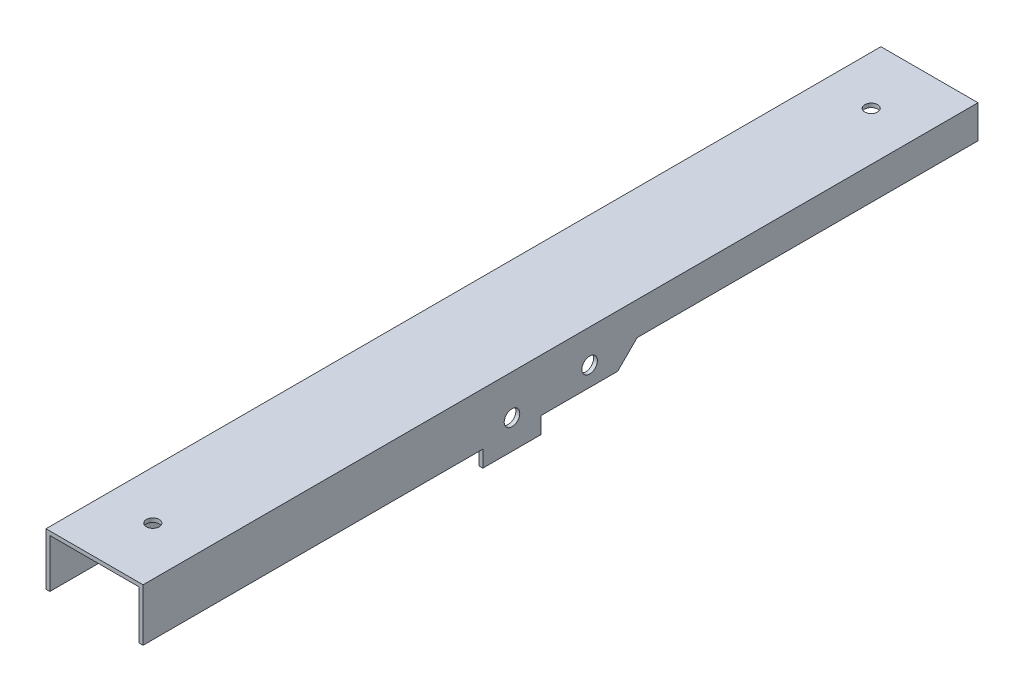
ISO-10303-21;
HEADER;
FILE_DESCRIPTION(('STEP AP214'),'2;1');
FILE_NAME('part.step','',(''),(''),'','','');
FILE_SCHEMA(('AUTOMOTIVE_DESIGN { 1 0 10303 214 1 1 1 1 }'));
ENDSEC;
DATA;
#1=APPLICATION_CONTEXT('core data for automotive mechanical design processes');
#2=APPLICATION_PROTOCOL_DEFINITION('international standard','automotive_design',2000,#1);
#3=PRODUCT_CONTEXT('',#1,'mechanical');
#4=PRODUCT('Part','Part','',(#3));
#5=PRODUCT_RELATED_PRODUCT_CATEGORY('part','',(#4));
#6=PRODUCT_DEFINITION_FORMATION('','',#4);
#7=PRODUCT_DEFINITION_CONTEXT('part definition',#1,'design');
#8=PRODUCT_DEFINITION('design','',#6,#7);
#9=PRODUCT_DEFINITION_SHAPE('','',#8);
#10=(LENGTH_UNIT() NAMED_UNIT(*) SI_UNIT(.MILLI.,.METRE.));
#11=(NAMED_UNIT(*) PLANE_ANGLE_UNIT() SI_UNIT($,.RADIAN.));
#12=(NAMED_UNIT(*) SI_UNIT($,.STERADIAN.) SOLID_ANGLE_UNIT());
#13=UNCERTAINTY_MEASURE_WITH_UNIT(LENGTH_MEASURE(1.E-05),#10,'distance_accuracy_value','');
#14=(GEOMETRIC_REPRESENTATION_CONTEXT(3) GLOBAL_UNCERTAINTY_ASSIGNED_CONTEXT((#13)) GLOBAL_UNIT_ASSIGNED_CONTEXT((#10,
#11,#12)) REPRESENTATION_CONTEXT('',''));
#15=CARTESIAN_POINT('',(0.,0.,0.));
#16=DIRECTION('',(0.,0.,1.));
#17=DIRECTION('',(1.,0.,0.));
#18=AXIS2_PLACEMENT_3D('',#15,#16,#17);
#19=CARTESIAN_POINT('',(-2.,-10.,230.));
#20=DIRECTION('',(0.,0.,1.));
#21=DIRECTION('',(1.,0.,0.));
#22=AXIS2_PLACEMENT_3D('',#19,#20,#21);
#23=PLANE('',#22);
#24=DIRECTION('',(0.,-1.,0.));
#25=VECTOR('',#24,1.);
#26=CARTESIAN_POINT('',(0.,-10.,230.));
#27=LINE('',#26,#25);
#28=CARTESIAN_POINT('',(0.,17.,230.));
#29=VERTEX_POINT('',#28);
#30=CARTESIAN_POINT('',(0.,-10.,230.));
#31=VERTEX_POINT('',#30);
#32=EDGE_CURVE('E143',#29,#31,#27,.T.);
#33=ORIENTED_EDGE('',*,*,#32,.F.);
#34=DIRECTION('',(1.,0.,0.));
#35=VECTOR('',#34,1.);
#36=CARTESIAN_POINT('',(0.,17.,230.));
#37=LINE('',#36,#35);
#38=CARTESIAN_POINT('',(-50.,17.,230.));
#39=VERTEX_POINT('',#38);
#40=EDGE_CURVE('E296',#39,#29,#37,.T.);
#41=ORIENTED_EDGE('',*,*,#40,.F.);
#42=DIRECTION('',(0.,-1.,0.));
#43=VECTOR('',#42,1.);
#44=CARTESIAN_POINT('',(-50.,-10.,230.));
#45=LINE('',#44,#43);
#46=CARTESIAN_POINT('',(-50.,-10.,230.));
#47=VERTEX_POINT('',#46);
#48=EDGE_CURVE('E205',#39,#47,#45,.T.);
#49=ORIENTED_EDGE('',*,*,#48,.T.);
#50=DIRECTION('',(-1.,0.,0.));
#51=VECTOR('',#50,1.);
#52=CARTESIAN_POINT('',(-47.9999999999999,-10.,230.));
#53=LINE('',#52,#51);
#54=CARTESIAN_POINT('',(-47.9999999999999,-10.,230.));
#55=VERTEX_POINT('',#54);
#56=EDGE_CURVE('E239',#55,#47,#53,.T.);
#57=ORIENTED_EDGE('',*,*,#56,.F.);
#58=DIRECTION('',(0.,-1.,0.));
#59=VECTOR('',#58,1.);
#60=CARTESIAN_POINT('',(-47.9999999999999,-10.,230.));
#61=LINE('',#60,#59);
#62=CARTESIAN_POINT('',(-47.9999999999999,15.,230.));
#63=VERTEX_POINT('',#62);
#64=EDGE_CURVE('E208',#63,#55,#61,.T.);
#65=ORIENTED_EDGE('',*,*,#64,.F.);
#66=DIRECTION('',(1.,0.,0.));
#67=VECTOR('',#66,1.);
#68=CARTESIAN_POINT('',(0.,15.,230.));
#69=LINE('',#68,#67);
#70=CARTESIAN_POINT('',(-2.,15.,230.));
#71=VERTEX_POINT('',#70);
#72=EDGE_CURVE('E293',#63,#71,#69,.T.);
#73=ORIENTED_EDGE('',*,*,#72,.T.);
#74=DIRECTION('',(0.,-1.,0.));
#75=VECTOR('',#74,1.);
#76=CARTESIAN_POINT('',(-2.,-10.,230.));
#77=LINE('',#76,#75);
#78=CARTESIAN_POINT('',(-2.,-10.,230.));
#79=VERTEX_POINT('',#78);
#80=EDGE_CURVE('E167',#71,#79,#77,.T.);
#81=ORIENTED_EDGE('',*,*,#80,.T.);
#82=DIRECTION('',(1.,0.,0.));
#83=VECTOR('',#82,1.);
#84=CARTESIAN_POINT('',(-2.,-10.,230.));
#85=LINE('',#84,#83);
#86=EDGE_CURVE('E98',#79,#31,#85,.T.);
#87=ORIENTED_EDGE('',*,*,#86,.T.);
#88=EDGE_LOOP('',(#33,#41,#49,#57,#65,#73,#81,#87));
#89=FACE_BOUND('',#88,.T.);
#90=ADVANCED_FACE('F39',(#89),#23,.T.);
#91=CARTESIAN_POINT('',(-2.,15.,-200.));
#92=DIRECTION('',(0.,0.,-1.));
#93=DIRECTION('',(-1.,0.,0.));
#94=AXIS2_PLACEMENT_3D('',#91,#92,#93);
#95=PLANE('',#94);
#96=DIRECTION('',(0.,1.,0.));
#97=VECTOR('',#96,1.);
#98=CARTESIAN_POINT('',(0.,15.,-200.));
#99=LINE('',#98,#97);
#100=CARTESIAN_POINT('',(0.,0.,-200.));
#101=VERTEX_POINT('',#100);
#102=CARTESIAN_POINT('',(0.,17.,-200.));
#103=VERTEX_POINT('',#102);
#104=EDGE_CURVE('E165',#101,#103,#99,.T.);
#105=ORIENTED_EDGE('',*,*,#104,.F.);
#106=DIRECTION('',(1.,0.,0.));
#107=VECTOR('',#106,1.);
#108=CARTESIAN_POINT('',(-2.,0.,-200.));
#109=LINE('',#108,#107);
#110=CARTESIAN_POINT('',(-2.,0.,-200.));
#111=VERTEX_POINT('',#110);
#112=EDGE_CURVE('E11',#111,#101,#109,.T.);
#113=ORIENTED_EDGE('',*,*,#112,.F.);
#114=DIRECTION('',(0.,1.,0.));
#115=VECTOR('',#114,1.);
#116=CARTESIAN_POINT('',(-2.,15.,-200.));
#117=LINE('',#116,#115);
#118=CARTESIAN_POINT('',(-2.,15.,-200.));
#119=VERTEX_POINT('',#118);
#120=EDGE_CURVE('E57',#111,#119,#117,.T.);
#121=ORIENTED_EDGE('',*,*,#120,.T.);
#122=DIRECTION('',(-1.,0.,0.));
#123=VECTOR('',#122,1.);
#124=CARTESIAN_POINT('',(0.,15.,-200.));
#125=LINE('',#124,#123);
#126=CARTESIAN_POINT('',(-48.,15.,-200.));
#127=VERTEX_POINT('',#126);
#128=EDGE_CURVE('E268',#119,#127,#125,.T.);
#129=ORIENTED_EDGE('',*,*,#128,.T.);
#130=DIRECTION('',(0.,1.,0.));
#131=VECTOR('',#130,1.);
#132=CARTESIAN_POINT('',(-48.,15.,-200.));
#133=LINE('',#132,#131);
#134=CARTESIAN_POINT('',(-48.,0.,-200.));
#135=VERTEX_POINT('',#134);
#136=EDGE_CURVE('E233',#135,#127,#133,.T.);
#137=ORIENTED_EDGE('',*,*,#136,.F.);
#138=DIRECTION('',(-1.,0.,0.));
#139=VECTOR('',#138,1.);
#140=CARTESIAN_POINT('',(-48.,0.,-200.));
#141=LINE('',#140,#139);
#142=CARTESIAN_POINT('',(-50.,0.,-200.));
#143=VERTEX_POINT('',#142);
#144=EDGE_CURVE('E265',#135,#143,#141,.T.);
#145=ORIENTED_EDGE('',*,*,#144,.T.);
#146=DIRECTION('',(0.,1.,0.));
#147=VECTOR('',#146,1.);
#148=CARTESIAN_POINT('',(-50.,15.,-200.));
#149=LINE('',#148,#147);
#150=CARTESIAN_POINT('',(-50.,17.,-200.));
#151=VERTEX_POINT('',#150);
#152=EDGE_CURVE('E212',#143,#151,#149,.T.);
#153=ORIENTED_EDGE('',*,*,#152,.T.);
#154=DIRECTION('',(-1.,0.,0.));
#155=VECTOR('',#154,1.);
#156=CARTESIAN_POINT('',(0.,17.,-200.));
#157=LINE('',#156,#155);
#158=EDGE_CURVE('E292',#103,#151,#157,.T.);
#159=ORIENTED_EDGE('',*,*,#158,.F.);
#160=EDGE_LOOP('',(#105,#113,#121,#129,#137,#145,#153,#159));
#161=FACE_BOUND('',#160,.T.);
#162=ADVANCED_FACE('F413',(#161),#95,.T.);
#163=CARTESIAN_POINT('',(-2.,0.,-24.437443040179));
#164=DIRECTION('',(0.,-1.,0.));
#165=DIRECTION('',(0.,0.,-1.));
#166=AXIS2_PLACEMENT_3D('',#163,#164,#165);
#167=PLANE('',#166);
#168=DIRECTION('',(0.,0.,-1.));
#169=VECTOR('',#168,1.);
#170=CARTESIAN_POINT('',(0.,0.,-24.437443040179));
#171=LINE('',#170,#169);
#172=CARTESIAN_POINT('',(0.,0.,-24.437443040179));
#173=VERTEX_POINT('',#172);
#174=EDGE_CURVE('E120',#173,#101,#171,.T.);
#175=ORIENTED_EDGE('',*,*,#174,.F.);
#176=DIRECTION('',(1.,0.,0.));
#177=VECTOR('',#176,1.);
#178=CARTESIAN_POINT('',(-2.,0.,-24.437443040179));
#179=LINE('',#178,#177);
#180=CARTESIAN_POINT('',(-2.,0.,-24.437443040179));
#181=VERTEX_POINT('',#180);
#182=EDGE_CURVE('E48',#181,#173,#179,.T.);
#183=ORIENTED_EDGE('',*,*,#182,.F.);
#184=DIRECTION('',(0.,0.,-1.));
#185=VECTOR('',#184,1.);
#186=CARTESIAN_POINT('',(-2.,0.,-24.437443040179));
#187=LINE('',#186,#185);
#188=EDGE_CURVE('E118',#181,#111,#187,.T.);
#189=ORIENTED_EDGE('',*,*,#188,.T.);
#190=ORIENTED_EDGE('',*,*,#112,.T.);
#191=EDGE_LOOP('',(#175,#183,#189,#190));
#192=FACE_BOUND('',#191,.T.);
#193=ADVANCED_FACE('F117',(#192),#167,.T.);
#194=CARTESIAN_POINT('',(-2.,-9.99999999999999,-14.4374430401789));
#195=DIRECTION('',(0.,-0.707106781186551,-0.707106781186544));
#196=DIRECTION('',(0.,0.707106781186544,-0.707106781186551));
#197=AXIS2_PLACEMENT_3D('',#194,#195,#196);
#198=PLANE('',#197);
#199=DIRECTION('',(0.,0.707106781186544,-0.707106781186551));
#200=VECTOR('',#199,1.);
#201=CARTESIAN_POINT('',(0.,-9.99999999999999,-14.4374430401789));
#202=LINE('',#201,#200);
#203=CARTESIAN_POINT('',(0.,-9.99999999999999,-14.4374430401789));
#204=VERTEX_POINT('',#203);
#205=EDGE_CURVE('E162',#204,#173,#202,.T.);
#206=ORIENTED_EDGE('',*,*,#205,.F.);
#207=DIRECTION('',(1.,0.,0.));
#208=VECTOR('',#207,1.);
#209=CARTESIAN_POINT('',(-2.,-9.99999999999999,-14.4374430401789));
#210=LINE('',#209,#208);
#211=CARTESIAN_POINT('',(-2.,-9.99999999999999,-14.4374430401789));
#212=VERTEX_POINT('',#211);
#213=EDGE_CURVE('E122',#212,#204,#210,.T.);
#214=ORIENTED_EDGE('',*,*,#213,.F.);
#215=DIRECTION('',(0.,0.707106781186544,-0.707106781186551));
#216=VECTOR('',#215,1.);
#217=CARTESIAN_POINT('',(-2.,-9.99999999999999,-14.4374430401789));
#218=LINE('',#217,#216);
#219=EDGE_CURVE('E129',#212,#181,#218,.T.);
#220=ORIENTED_EDGE('',*,*,#219,.T.);
#221=ORIENTED_EDGE('',*,*,#182,.T.);
#222=EDGE_LOOP('',(#206,#214,#220,#221));
#223=FACE_BOUND('',#222,.T.);
#224=ADVANCED_FACE('F132',(#223),#198,.T.);
#225=CARTESIAN_POINT('',(-2.,-9.99999999999999,-14.4374430401789));
#226=DIRECTION('',(0.,-1.,0.));
#227=DIRECTION('',(0.,0.,-1.));
#228=AXIS2_PLACEMENT_3D('',#225,#226,#227);
#229=PLANE('',#228);
#230=DIRECTION('',(0.,0.,-1.));
#231=VECTOR('',#230,1.);
#232=CARTESIAN_POINT('',(0.,-9.99999999999999,-14.4374430401789));
#233=LINE('',#232,#231);
#234=CARTESIAN_POINT('',(0.,-10.,25.));
#235=VERTEX_POINT('',#234);
#236=EDGE_CURVE('E159',#235,#204,#233,.T.);
#237=ORIENTED_EDGE('',*,*,#236,.F.);
#238=DIRECTION('',(1.,0.,0.));
#239=VECTOR('',#238,1.);
#240=CARTESIAN_POINT('',(-2.,-10.,25.));
#241=LINE('',#240,#239);
#242=CARTESIAN_POINT('',(-2.,-10.,25.));
#243=VERTEX_POINT('',#242);
#244=EDGE_CURVE('E170',#243,#235,#241,.T.);
#245=ORIENTED_EDGE('',*,*,#244,.F.);
#246=DIRECTION('',(0.,0.,-1.));
#247=VECTOR('',#246,1.);
#248=CARTESIAN_POINT('',(-2.,-9.99999999999999,-14.4374430401789));
#249=LINE('',#248,#247);
#250=EDGE_CURVE('E133',#243,#212,#249,.T.);
#251=ORIENTED_EDGE('',*,*,#250,.T.);
#252=ORIENTED_EDGE('',*,*,#213,.T.);
#253=EDGE_LOOP('',(#237,#245,#251,#252));
#254=FACE_BOUND('',#253,.T.);
#255=ADVANCED_FACE('F464',(#254),#229,.T.);
#256=CARTESIAN_POINT('',(-2.,-10.,25.));
#257=DIRECTION('',(0.,0.,-1.));
#258=DIRECTION('',(0.,1.,0.));
#259=AXIS2_PLACEMENT_3D('',#256,#257,#258);
#260=PLANE('',#259);
#261=DIRECTION('',(0.,1.,0.));
#262=VECTOR('',#261,1.);
#263=CARTESIAN_POINT('',(0.,-10.,25.));
#264=LINE('',#263,#262);
#265=CARTESIAN_POINT('',(0.,-18.499546541037,25.));
#266=VERTEX_POINT('',#265);
#267=EDGE_CURVE('E156',#266,#235,#264,.T.);
#268=ORIENTED_EDGE('',*,*,#267,.F.);
#269=DIRECTION('',(1.,0.,0.));
#270=VECTOR('',#269,1.);
#271=CARTESIAN_POINT('',(-2.,-18.499546541037,25.));
#272=LINE('',#271,#270);
#273=CARTESIAN_POINT('',(-2.,-18.499546541037,25.));
#274=VERTEX_POINT('',#273);
#275=EDGE_CURVE('E172',#274,#266,#272,.T.);
#276=ORIENTED_EDGE('',*,*,#275,.F.);
#277=DIRECTION('',(0.,1.,0.));
#278=VECTOR('',#277,1.);
#279=CARTESIAN_POINT('',(-2.,-10.,25.));
#280=LINE('',#279,#278);
#281=EDGE_CURVE('E135',#274,#243,#280,.T.);
#282=ORIENTED_EDGE('',*,*,#281,.T.);
#283=ORIENTED_EDGE('',*,*,#244,.T.);
#284=EDGE_LOOP('',(#268,#276,#282,#283));
#285=FACE_BOUND('',#284,.T.);
#286=ADVANCED_FACE('F326',(#285),#260,.T.);
#287=CARTESIAN_POINT('',(-2.,-18.499546541037,25.));
#288=DIRECTION('',(0.,-1.,0.));
#289=DIRECTION('',(0.,0.,-1.));
#290=AXIS2_PLACEMENT_3D('',#287,#288,#289);
#291=PLANE('',#290);
#292=DIRECTION('',(0.,0.,-1.));
#293=VECTOR('',#292,1.);
#294=CARTESIAN_POINT('',(0.,-18.499546541037,25.));
#295=LINE('',#294,#293);
#296=CARTESIAN_POINT('',(0.,-18.499546541037,55.));
#297=VERTEX_POINT('',#296);
#298=EDGE_CURVE('E153',#297,#266,#295,.T.);
#299=ORIENTED_EDGE('',*,*,#298,.F.);
#300=DIRECTION('',(1.,0.,0.));
#301=VECTOR('',#300,1.);
#302=CARTESIAN_POINT('',(-2.,-18.499546541037,55.));
#303=LINE('',#302,#301);
#304=CARTESIAN_POINT('',(-2.,-18.499546541037,55.));
#305=VERTEX_POINT('',#304);
#306=EDGE_CURVE('E174',#305,#297,#303,.T.);
#307=ORIENTED_EDGE('',*,*,#306,.F.);
#308=DIRECTION('',(0.,0.,-1.));
#309=VECTOR('',#308,1.);
#310=CARTESIAN_POINT('',(-2.,-18.499546541037,25.));
#311=LINE('',#310,#309);
#312=EDGE_CURVE('E320',#305,#274,#311,.T.);
#313=ORIENTED_EDGE('',*,*,#312,.T.);
#314=ORIENTED_EDGE('',*,*,#275,.T.);
#315=EDGE_LOOP('',(#299,#307,#313,#314));
#316=FACE_BOUND('',#315,.T.);
#317=ADVANCED_FACE('F332',(#316),#291,.T.);
#318=CARTESIAN_POINT('',(-2.,-18.499546541037,55.));
#319=DIRECTION('',(0.,0.,1.));
#320=DIRECTION('',(1.,0.,0.));
#321=AXIS2_PLACEMENT_3D('',#318,#319,#320);
#322=PLANE('',#321);
#323=DIRECTION('',(0.,-1.,0.));
#324=VECTOR('',#323,1.);
#325=CARTESIAN_POINT('',(0.,-18.499546541037,55.));
#326=LINE('',#325,#324);
#327=CARTESIAN_POINT('',(0.,-9.99999999999999,55.));
#328=VERTEX_POINT('',#327);
#329=EDGE_CURVE('E150',#328,#297,#326,.T.);
#330=ORIENTED_EDGE('',*,*,#329,.F.);
#331=DIRECTION('',(1.,0.,0.));
#332=VECTOR('',#331,1.);
#333=CARTESIAN_POINT('',(-2.,-9.99999999999999,55.));
#334=LINE('',#333,#332);
#335=CARTESIAN_POINT('',(-2.,-9.99999999999999,55.));
#336=VERTEX_POINT('',#335);
#337=EDGE_CURVE('E176',#336,#328,#334,.T.);
#338=ORIENTED_EDGE('',*,*,#337,.F.);
#339=DIRECTION('',(0.,-1.,0.));
#340=VECTOR('',#339,1.);
#341=CARTESIAN_POINT('',(-2.,-18.499546541037,55.));
#342=LINE('',#341,#340);
#343=EDGE_CURVE('E317',#336,#305,#342,.T.);
#344=ORIENTED_EDGE('',*,*,#343,.T.);
#345=ORIENTED_EDGE('',*,*,#306,.T.);
#346=EDGE_LOOP('',(#330,#338,#344,#345));
#347=FACE_BOUND('',#346,.T.);
#348=ADVANCED_FACE('F335',(#347),#322,.T.);
#349=CARTESIAN_POINT('',(-2.,-9.99999999999999,55.));
#350=DIRECTION('',(0.,-1.,0.));
#351=DIRECTION('',(0.,0.,-1.));
#352=AXIS2_PLACEMENT_3D('',#349,#350,#351);
#353=PLANE('',#352);
#354=DIRECTION('',(0.,0.,-1.));
#355=VECTOR('',#354,1.);
#356=CARTESIAN_POINT('',(0.,-9.99999999999999,55.));
#357=LINE('',#356,#355);
#358=EDGE_CURVE('E146',#31,#328,#357,.T.);
#359=ORIENTED_EDGE('',*,*,#358,.F.);
#360=ORIENTED_EDGE('',*,*,#86,.F.);
#361=DIRECTION('',(0.,0.,-1.));
#362=VECTOR('',#361,1.);
#363=CARTESIAN_POINT('',(-2.,-9.99999999999999,55.));
#364=LINE('',#363,#362);
#365=EDGE_CURVE('E315',#79,#336,#364,.T.);
#366=ORIENTED_EDGE('',*,*,#365,.T.);
#367=ORIENTED_EDGE('',*,*,#337,.T.);
#368=EDGE_LOOP('',(#359,#360,#366,#367));
#369=FACE_BOUND('',#368,.T.);
#370=ADVANCED_FACE('F336',(#369),#353,.T.);
#371=CARTESIAN_POINT('',(-2.,0.,0.));
#372=DIRECTION('',(-1.,0.,0.));
#373=DIRECTION('',(0.,0.,1.));
#374=AXIS2_PLACEMENT_3D('',#371,#372,#373);
#375=PLANE('',#374);
#376=CARTESIAN_POINT('',(-2.,-3.49954654103696,40.));
#377=DIRECTION('',(1.,0.,0.));
#378=DIRECTION('',(0.,0.,-1.));
#379=AXIS2_PLACEMENT_3D('',#376,#377,#378);
#380=CIRCLE('',#379,4.);
#381=CARTESIAN_POINT('',(-2.,-3.49954654103696,36.));
#382=VERTEX_POINT('',#381);
#383=EDGE_CURVE('E303',#382,#382,#380,.T.);
#384=ORIENTED_EDGE('',*,*,#383,.T.);
#385=EDGE_LOOP('',(#384));
#386=FACE_BOUND('',#385,.T.);
#387=CARTESIAN_POINT('',(-2.,0.,0.));
#388=DIRECTION('',(1.,0.,0.));
#389=DIRECTION('',(0.,0.,-1.));
#390=AXIS2_PLACEMENT_3D('',#387,#388,#389);
#391=CIRCLE('',#390,4.);
#392=CARTESIAN_POINT('',(-2.,0.,-4.));
#393=VERTEX_POINT('',#392);
#394=EDGE_CURVE('E147',#393,#393,#391,.T.);
#395=ORIENTED_EDGE('',*,*,#394,.T.);
#396=EDGE_LOOP('',(#395));
#397=FACE_BOUND('',#396,.T.);
#398=ORIENTED_EDGE('',*,*,#80,.F.);
#399=DIRECTION('',(0.,0.,1.));
#400=VECTOR('',#399,1.);
#401=CARTESIAN_POINT('',(-2.,15.,230.));
#402=LINE('',#401,#400);
#403=EDGE_CURVE('E140',#119,#71,#402,.T.);
#404=ORIENTED_EDGE('',*,*,#403,.F.);
#405=ORIENTED_EDGE('',*,*,#120,.F.);
#406=ORIENTED_EDGE('',*,*,#188,.F.);
#407=ORIENTED_EDGE('',*,*,#219,.F.);
#408=ORIENTED_EDGE('',*,*,#250,.F.);
#409=ORIENTED_EDGE('',*,*,#281,.F.);
#410=ORIENTED_EDGE('',*,*,#312,.F.);
#411=ORIENTED_EDGE('',*,*,#343,.F.);
#412=ORIENTED_EDGE('',*,*,#365,.F.);
#413=EDGE_LOOP('',(#398,#404,#405,#406,#407,#408,#409,#410,#411,#412));
#414=FACE_BOUND('',#413,.T.);
#415=ADVANCED_FACE('F127',(#386,#397,#414),#375,.T.);
#416=CARTESIAN_POINT('',(0.,0.,0.));
#417=DIRECTION('',(-1.,0.,0.));
#418=DIRECTION('',(0.,0.,1.));
#419=AXIS2_PLACEMENT_3D('',#416,#417,#418);
#420=PLANE('',#419);
#421=CARTESIAN_POINT('',(0.,-3.49954654103696,40.));
#422=DIRECTION('',(1.,0.,0.));
#423=DIRECTION('',(0.,0.,-1.));
#424=AXIS2_PLACEMENT_3D('',#421,#422,#423);
#425=CIRCLE('',#424,4.);
#426=CARTESIAN_POINT('',(0.,-3.49954654103696,36.));
#427=VERTEX_POINT('',#426);
#428=EDGE_CURVE('E299',#427,#427,#425,.T.);
#429=ORIENTED_EDGE('',*,*,#428,.F.);
#430=EDGE_LOOP('',(#429));
#431=FACE_BOUND('',#430,.T.);
#432=CARTESIAN_POINT('',(0.,0.,0.));
#433=DIRECTION('',(1.,0.,0.));
#434=DIRECTION('',(0.,0.,-1.));
#435=AXIS2_PLACEMENT_3D('',#432,#433,#434);
#436=CIRCLE('',#435,4.);
#437=CARTESIAN_POINT('',(0.,0.,-4.));
#438=VERTEX_POINT('',#437);
#439=EDGE_CURVE('E306',#438,#438,#436,.T.);
#440=ORIENTED_EDGE('',*,*,#439,.F.);
#441=EDGE_LOOP('',(#440));
#442=FACE_BOUND('',#441,.T.);
#443=ORIENTED_EDGE('',*,*,#32,.T.);
#444=ORIENTED_EDGE('',*,*,#358,.T.);
#445=ORIENTED_EDGE('',*,*,#329,.T.);
#446=ORIENTED_EDGE('',*,*,#298,.T.);
#447=ORIENTED_EDGE('',*,*,#267,.T.);
#448=ORIENTED_EDGE('',*,*,#236,.T.);
#449=ORIENTED_EDGE('',*,*,#205,.T.);
#450=ORIENTED_EDGE('',*,*,#174,.T.);
#451=ORIENTED_EDGE('',*,*,#104,.T.);
#452=DIRECTION('',(0.,0.,-1.));
#453=VECTOR('',#452,1.);
#454=CARTESIAN_POINT('',(0.,17.,230.));
#455=LINE('',#454,#453);
#456=EDGE_CURVE('E289',#29,#103,#455,.T.);
#457=ORIENTED_EDGE('',*,*,#456,.F.);
#458=EDGE_LOOP('',(#443,#444,#445,#446,#447,#448,#449,#450,#451,#457));
#459=FACE_BOUND('',#458,.T.);
#460=ADVANCED_FACE('F340',(#431,#442,#459),#420,.F.);
#461=CARTESIAN_POINT('',(-2.,0.,0.));
#462=DIRECTION('',(1.,0.,0.));
#463=DIRECTION('',(0.,0.,-1.));
#464=AXIS2_PLACEMENT_3D('',#461,#462,#463);
#465=CYLINDRICAL_SURFACE('',#464,4.);
#466=ORIENTED_EDGE('',*,*,#394,.F.);
#467=EDGE_LOOP('',(#466));
#468=FACE_BOUND('',#467,.T.);
#469=ORIENTED_EDGE('',*,*,#439,.T.);
#470=EDGE_LOOP('',(#469));
#471=FACE_BOUND('',#470,.T.);
#472=ADVANCED_FACE('F481',(#468,#471),#465,.F.);
#473=CARTESIAN_POINT('',(-2.,-3.49954654103696,40.));
#474=DIRECTION('',(1.,0.,0.));
#475=DIRECTION('',(0.,0.,-1.));
#476=AXIS2_PLACEMENT_3D('',#473,#474,#475);
#477=CYLINDRICAL_SURFACE('',#476,4.);
#478=ORIENTED_EDGE('',*,*,#383,.F.);
#479=EDGE_LOOP('',(#478));
#480=FACE_BOUND('',#479,.T.);
#481=ORIENTED_EDGE('',*,*,#428,.T.);
#482=EDGE_LOOP('',(#481));
#483=FACE_BOUND('',#482,.T.);
#484=ADVANCED_FACE('F487',(#480,#483),#477,.F.);
#485=CARTESIAN_POINT('',(0.,15.,0.));
#486=DIRECTION('',(0.,1.,0.));
#487=DIRECTION('',(0.,0.,1.));
#488=AXIS2_PLACEMENT_3D('',#485,#486,#487);
#489=PLANE('',#488);
#490=CARTESIAN_POINT('',(-25.,15.,200.));
#491=DIRECTION('',(0.,1.,0.));
#492=DIRECTION('',(0.,0.,1.));
#493=AXIS2_PLACEMENT_3D('',#490,#491,#492);
#494=CIRCLE('',#493,3.30000000000001);
#495=CARTESIAN_POINT('',(-25.,15.,203.3));
#496=VERTEX_POINT('',#495);
#497=EDGE_CURVE('E188',#496,#496,#494,.T.);
#498=ORIENTED_EDGE('',*,*,#497,.T.);
#499=EDGE_LOOP('',(#498));
#500=FACE_BOUND('',#499,.T.);
#501=CARTESIAN_POINT('',(-25.,15.,-170.));
#502=DIRECTION('',(0.,1.,0.));
#503=DIRECTION('',(0.,0.,1.));
#504=AXIS2_PLACEMENT_3D('',#501,#502,#503);
#505=CIRCLE('',#504,3.3);
#506=CARTESIAN_POINT('',(-25.,15.,-166.7));
#507=VERTEX_POINT('',#506);
#508=EDGE_CURVE('E180',#507,#507,#505,.T.);
#509=ORIENTED_EDGE('',*,*,#508,.T.);
#510=EDGE_LOOP('',(#509));
#511=FACE_BOUND('',#510,.T.);
#512=ORIENTED_EDGE('',*,*,#128,.F.);
#513=ORIENTED_EDGE('',*,*,#403,.T.);
#514=ORIENTED_EDGE('',*,*,#72,.F.);
#515=DIRECTION('',(0.,0.,1.));
#516=VECTOR('',#515,1.);
#517=CARTESIAN_POINT('',(-47.9999999999999,15.,230.));
#518=LINE('',#517,#516);
#519=EDGE_CURVE('E236',#127,#63,#518,.T.);
#520=ORIENTED_EDGE('',*,*,#519,.F.);
#521=EDGE_LOOP('',(#512,#513,#514,#520));
#522=FACE_BOUND('',#521,.T.);
#523=ADVANCED_FACE('F412',(#500,#511,#522),#489,.F.);
#524=CARTESIAN_POINT('',(0.,17.,0.));
#525=DIRECTION('',(0.,1.,0.));
#526=DIRECTION('',(0.,0.,1.));
#527=AXIS2_PLACEMENT_3D('',#524,#525,#526);
#528=PLANE('',#527);
#529=CARTESIAN_POINT('',(-25.,17.,200.));
#530=DIRECTION('',(0.,1.,0.));
#531=DIRECTION('',(0.,0.,1.));
#532=AXIS2_PLACEMENT_3D('',#529,#530,#531);
#533=CIRCLE('',#532,3.30000000000001);
#534=CARTESIAN_POINT('',(-25.,17.,203.3));
#535=VERTEX_POINT('',#534);
#536=EDGE_CURVE('E42',#535,#535,#533,.T.);
#537=ORIENTED_EDGE('',*,*,#536,.F.);
#538=EDGE_LOOP('',(#537));
#539=FACE_BOUND('',#538,.T.);
#540=CARTESIAN_POINT('',(-25.,17.,-170.));
#541=DIRECTION('',(0.,1.,0.));
#542=DIRECTION('',(0.,0.,1.));
#543=AXIS2_PLACEMENT_3D('',#540,#541,#542);
#544=CIRCLE('',#543,3.3);
#545=CARTESIAN_POINT('',(-25.,17.,-166.7));
#546=VERTEX_POINT('',#545);
#547=EDGE_CURVE('E178',#546,#546,#544,.T.);
#548=ORIENTED_EDGE('',*,*,#547,.F.);
#549=EDGE_LOOP('',(#548));
#550=FACE_BOUND('',#549,.T.);
#551=ORIENTED_EDGE('',*,*,#456,.T.);
#552=ORIENTED_EDGE('',*,*,#158,.T.);
#553=DIRECTION('',(0.,0.,-1.));
#554=VECTOR('',#553,1.);
#555=CARTESIAN_POINT('',(-50.,17.,230.));
#556=LINE('',#555,#554);
#557=EDGE_CURVE('E192',#39,#151,#556,.T.);
#558=ORIENTED_EDGE('',*,*,#557,.F.);
#559=ORIENTED_EDGE('',*,*,#40,.T.);
#560=EDGE_LOOP('',(#551,#552,#558,#559));
#561=FACE_BOUND('',#560,.T.);
#562=ADVANCED_FACE('F348',(#539,#550,#561),#528,.T.);
#563=CARTESIAN_POINT('',(-48.,0.,-24.437443040179));
#564=DIRECTION('',(0.,-1.,0.));
#565=DIRECTION('',(0.,0.,-1.));
#566=AXIS2_PLACEMENT_3D('',#563,#564,#565);
#567=PLANE('',#566);
#568=DIRECTION('',(0.,0.,-1.));
#569=VECTOR('',#568,1.);
#570=CARTESIAN_POINT('',(-50.,0.,-24.437443040179));
#571=LINE('',#570,#569);
#572=CARTESIAN_POINT('',(-50.,0.,-24.437443040179));
#573=VERTEX_POINT('',#572);
#574=EDGE_CURVE('E260',#573,#143,#571,.T.);
#575=ORIENTED_EDGE('',*,*,#574,.T.);
#576=ORIENTED_EDGE('',*,*,#144,.F.);
#577=DIRECTION('',(0.,0.,-1.));
#578=VECTOR('',#577,1.);
#579=CARTESIAN_POINT('',(-48.,0.,-24.437443040179));
#580=LINE('',#579,#578);
#581=CARTESIAN_POINT('',(-48.,0.,-24.437443040179));
#582=VERTEX_POINT('',#581);
#583=EDGE_CURVE('E230',#582,#135,#580,.T.);
#584=ORIENTED_EDGE('',*,*,#583,.F.);
#585=DIRECTION('',(-1.,0.,0.));
#586=VECTOR('',#585,1.);
#587=CARTESIAN_POINT('',(-48.,0.,-24.437443040179));
#588=LINE('',#587,#586);
#589=EDGE_CURVE('E269',#582,#573,#588,.T.);
#590=ORIENTED_EDGE('',*,*,#589,.T.);
#591=EDGE_LOOP('',(#575,#576,#584,#590));
#592=FACE_BOUND('',#591,.T.);
#593=ADVANCED_FACE('F418',(#592),#567,.T.);
#594=CARTESIAN_POINT('',(-48.,-9.99999999999999,-14.4374430401789));
#595=DIRECTION('',(0.,-0.707106781186551,-0.707106781186544));
#596=DIRECTION('',(0.,0.707106781186544,-0.707106781186551));
#597=AXIS2_PLACEMENT_3D('',#594,#595,#596);
#598=PLANE('',#597);
#599=DIRECTION('',(0.,0.707106781186544,-0.707106781186551));
#600=VECTOR('',#599,1.);
#601=CARTESIAN_POINT('',(-50.,-9.99999999999999,-14.4374430401789));
#602=LINE('',#601,#600);
#603=CARTESIAN_POINT('',(-50.,-9.99999999999999,-14.4374430401789));
#604=VERTEX_POINT('',#603);
#605=EDGE_CURVE('E257',#604,#573,#602,.T.);
#606=ORIENTED_EDGE('',*,*,#605,.T.);
#607=ORIENTED_EDGE('',*,*,#589,.F.);
#608=DIRECTION('',(0.,0.707106781186544,-0.707106781186551));
#609=VECTOR('',#608,1.);
#610=CARTESIAN_POINT('',(-48.,-9.99999999999999,-14.4374430401789));
#611=LINE('',#610,#609);
#612=CARTESIAN_POINT('',(-48.,-9.99999999999999,-14.4374430401789));
#613=VERTEX_POINT('',#612);
#614=EDGE_CURVE('E227',#613,#582,#611,.T.);
#615=ORIENTED_EDGE('',*,*,#614,.F.);
#616=DIRECTION('',(-1.,0.,0.));
#617=VECTOR('',#616,1.);
#618=CARTESIAN_POINT('',(-48.,-9.99999999999999,-14.4374430401789));
#619=LINE('',#618,#617);
#620=EDGE_CURVE('E272',#613,#604,#619,.T.);
#621=ORIENTED_EDGE('',*,*,#620,.T.);
#622=EDGE_LOOP('',(#606,#607,#615,#621));
#623=FACE_BOUND('',#622,.T.);
#624=ADVANCED_FACE('F422',(#623),#598,.T.);
#625=CARTESIAN_POINT('',(-48.,-9.99999999999999,-14.4374430401789));
#626=DIRECTION('',(0.,-1.,0.));
#627=DIRECTION('',(0.,0.,-1.));
#628=AXIS2_PLACEMENT_3D('',#625,#626,#627);
#629=PLANE('',#628);
#630=DIRECTION('',(0.,0.,-1.));
#631=VECTOR('',#630,1.);
#632=CARTESIAN_POINT('',(-50.,-9.99999999999999,-14.4374430401789));
#633=LINE('',#632,#631);
#634=CARTESIAN_POINT('',(-50.,-10.,25.));
#635=VERTEX_POINT('',#634);
#636=EDGE_CURVE('E254',#635,#604,#633,.T.);
#637=ORIENTED_EDGE('',*,*,#636,.T.);
#638=ORIENTED_EDGE('',*,*,#620,.F.);
#639=DIRECTION('',(0.,0.,-1.));
#640=VECTOR('',#639,1.);
#641=CARTESIAN_POINT('',(-48.,-9.99999999999999,-14.4374430401789));
#642=LINE('',#641,#640);
#643=CARTESIAN_POINT('',(-48.,-10.,25.));
#644=VERTEX_POINT('',#643);
#645=EDGE_CURVE('E224',#644,#613,#642,.T.);
#646=ORIENTED_EDGE('',*,*,#645,.F.);
#647=DIRECTION('',(-1.,0.,0.));
#648=VECTOR('',#647,1.);
#649=CARTESIAN_POINT('',(-48.,-10.,25.));
#650=LINE('',#649,#648);
#651=EDGE_CURVE('E275',#644,#635,#650,.T.);
#652=ORIENTED_EDGE('',*,*,#651,.T.);
#653=EDGE_LOOP('',(#637,#638,#646,#652));
#654=FACE_BOUND('',#653,.T.);
#655=ADVANCED_FACE('F426',(#654),#629,.T.);
#656=CARTESIAN_POINT('',(-48.,-10.,25.));
#657=DIRECTION('',(0.,0.,-1.));
#658=DIRECTION('',(0.,1.,0.));
#659=AXIS2_PLACEMENT_3D('',#656,#657,#658);
#660=PLANE('',#659);
#661=DIRECTION('',(0.,1.,0.));
#662=VECTOR('',#661,1.);
#663=CARTESIAN_POINT('',(-50.,-10.,25.));
#664=LINE('',#663,#662);
#665=CARTESIAN_POINT('',(-50.,-18.499546541037,25.));
#666=VERTEX_POINT('',#665);
#667=EDGE_CURVE('E251',#666,#635,#664,.T.);
#668=ORIENTED_EDGE('',*,*,#667,.T.);
#669=ORIENTED_EDGE('',*,*,#651,.F.);
#670=DIRECTION('',(0.,1.,0.));
#671=VECTOR('',#670,1.);
#672=CARTESIAN_POINT('',(-48.,-10.,25.));
#673=LINE('',#672,#671);
#674=CARTESIAN_POINT('',(-48.,-18.499546541037,25.));
#675=VERTEX_POINT('',#674);
#676=EDGE_CURVE('E221',#675,#644,#673,.T.);
#677=ORIENTED_EDGE('',*,*,#676,.F.);
#678=DIRECTION('',(-1.,0.,0.));
#679=VECTOR('',#678,1.);
#680=CARTESIAN_POINT('',(-48.,-18.499546541037,25.));
#681=LINE('',#680,#679);
#682=EDGE_CURVE('E278',#675,#666,#681,.T.);
#683=ORIENTED_EDGE('',*,*,#682,.T.);
#684=EDGE_LOOP('',(#668,#669,#677,#683));
#685=FACE_BOUND('',#684,.T.);
#686=ADVANCED_FACE('F431',(#685),#660,.T.);
#687=CARTESIAN_POINT('',(-48.,-18.499546541037,25.));
#688=DIRECTION('',(0.,-1.,0.));
#689=DIRECTION('',(0.,0.,-1.));
#690=AXIS2_PLACEMENT_3D('',#687,#688,#689);
#691=PLANE('',#690);
#692=DIRECTION('',(0.,0.,-1.));
#693=VECTOR('',#692,1.);
#694=CARTESIAN_POINT('',(-50.,-18.499546541037,25.));
#695=LINE('',#694,#693);
#696=CARTESIAN_POINT('',(-50.,-18.499546541037,55.));
#697=VERTEX_POINT('',#696);
#698=EDGE_CURVE('E248',#697,#666,#695,.T.);
#699=ORIENTED_EDGE('',*,*,#698,.T.);
#700=ORIENTED_EDGE('',*,*,#682,.F.);
#701=DIRECTION('',(0.,0.,-1.));
#702=VECTOR('',#701,1.);
#703=CARTESIAN_POINT('',(-48.,-18.499546541037,25.));
#704=LINE('',#703,#702);
#705=CARTESIAN_POINT('',(-48.,-18.499546541037,55.));
#706=VERTEX_POINT('',#705);
#707=EDGE_CURVE('E218',#706,#675,#704,.T.);
#708=ORIENTED_EDGE('',*,*,#707,.F.);
#709=DIRECTION('',(-1.,0.,0.));
#710=VECTOR('',#709,1.);
#711=CARTESIAN_POINT('',(-48.,-18.499546541037,55.));
#712=LINE('',#711,#710);
#713=EDGE_CURVE('E281',#706,#697,#712,.T.);
#714=ORIENTED_EDGE('',*,*,#713,.T.);
#715=EDGE_LOOP('',(#699,#700,#708,#714));
#716=FACE_BOUND('',#715,.T.);
#717=ADVANCED_FACE('F436',(#716),#691,.T.);
#718=CARTESIAN_POINT('',(-48.,-18.499546541037,55.));
#719=DIRECTION('',(0.,0.,1.));
#720=DIRECTION('',(-1.,0.,0.));
#721=AXIS2_PLACEMENT_3D('',#718,#719,#720);
#722=PLANE('',#721);
#723=DIRECTION('',(0.,-1.,0.));
#724=VECTOR('',#723,1.);
#725=CARTESIAN_POINT('',(-50.,-18.499546541037,55.));
#726=LINE('',#725,#724);
#727=CARTESIAN_POINT('',(-50.,-9.99999999999999,55.));
#728=VERTEX_POINT('',#727);
#729=EDGE_CURVE('E245',#728,#697,#726,.T.);
#730=ORIENTED_EDGE('',*,*,#729,.T.);
#731=ORIENTED_EDGE('',*,*,#713,.F.);
#732=DIRECTION('',(0.,-1.,0.));
#733=VECTOR('',#732,1.);
#734=CARTESIAN_POINT('',(-48.,-18.499546541037,55.));
#735=LINE('',#734,#733);
#736=CARTESIAN_POINT('',(-48.,-9.99999999999999,55.));
#737=VERTEX_POINT('',#736);
#738=EDGE_CURVE('E215',#737,#706,#735,.T.);
#739=ORIENTED_EDGE('',*,*,#738,.F.);
#740=DIRECTION('',(-1.,0.,0.));
#741=VECTOR('',#740,1.);
#742=CARTESIAN_POINT('',(-48.,-9.99999999999999,55.));
#743=LINE('',#742,#741);
#744=EDGE_CURVE('E284',#737,#728,#743,.T.);
#745=ORIENTED_EDGE('',*,*,#744,.T.);
#746=EDGE_LOOP('',(#730,#731,#739,#745));
#747=FACE_BOUND('',#746,.T.);
#748=ADVANCED_FACE('F439',(#747),#722,.T.);
#749=CARTESIAN_POINT('',(-48.,-9.99999999999999,55.));
#750=DIRECTION('',(0.,-1.,0.));
#751=DIRECTION('',(0.,0.,-1.));
#752=AXIS2_PLACEMENT_3D('',#749,#750,#751);
#753=PLANE('',#752);
#754=DIRECTION('',(0.,0.,-1.));
#755=VECTOR('',#754,1.);
#756=CARTESIAN_POINT('',(-50.,-9.99999999999999,55.));
#757=LINE('',#756,#755);
#758=EDGE_CURVE('E242',#47,#728,#757,.T.);
#759=ORIENTED_EDGE('',*,*,#758,.T.);
#760=ORIENTED_EDGE('',*,*,#744,.F.);
#761=DIRECTION('',(0.,0.,-1.));
#762=VECTOR('',#761,1.);
#763=CARTESIAN_POINT('',(-48.,-9.99999999999999,55.));
#764=LINE('',#763,#762);
#765=EDGE_CURVE('E211',#55,#737,#764,.T.);
#766=ORIENTED_EDGE('',*,*,#765,.F.);
#767=ORIENTED_EDGE('',*,*,#56,.T.);
#768=EDGE_LOOP('',(#759,#760,#766,#767));
#769=FACE_BOUND('',#768,.T.);
#770=ADVANCED_FACE('F408',(#769),#753,.T.);
#771=CARTESIAN_POINT('',(-48.,0.,0.));
#772=DIRECTION('',(1.,0.,0.));
#773=DIRECTION('',(0.,0.,1.));
#774=AXIS2_PLACEMENT_3D('',#771,#772,#773);
#775=PLANE('',#774);
#776=CARTESIAN_POINT('',(-48.,-3.49954654103696,40.));
#777=DIRECTION('',(1.,0.,0.));
#778=DIRECTION('',(0.,0.,-1.));
#779=AXIS2_PLACEMENT_3D('',#776,#777,#778);
#780=CIRCLE('',#779,4.);
#781=CARTESIAN_POINT('',(-48.,-3.49954654103696,36.));
#782=VERTEX_POINT('',#781);
#783=EDGE_CURVE('E196',#782,#782,#780,.T.);
#784=ORIENTED_EDGE('',*,*,#783,.F.);
#785=EDGE_LOOP('',(#784));
#786=FACE_BOUND('',#785,.T.);
#787=CARTESIAN_POINT('',(-48.,0.,0.));
#788=DIRECTION('',(1.,0.,0.));
#789=DIRECTION('',(0.,0.,-1.));
#790=AXIS2_PLACEMENT_3D('',#787,#788,#789);
#791=CIRCLE('',#790,4.);
#792=CARTESIAN_POINT('',(-48.,0.,-3.99999999999999));
#793=VERTEX_POINT('',#792);
#794=EDGE_CURVE('E202',#793,#793,#791,.T.);
#795=ORIENTED_EDGE('',*,*,#794,.F.);
#796=EDGE_LOOP('',(#795));
#797=FACE_BOUND('',#796,.T.);
#798=ORIENTED_EDGE('',*,*,#64,.T.);
#799=ORIENTED_EDGE('',*,*,#765,.T.);
#800=ORIENTED_EDGE('',*,*,#738,.T.);
#801=ORIENTED_EDGE('',*,*,#707,.T.);
#802=ORIENTED_EDGE('',*,*,#676,.T.);
#803=ORIENTED_EDGE('',*,*,#645,.T.);
#804=ORIENTED_EDGE('',*,*,#614,.T.);
#805=ORIENTED_EDGE('',*,*,#583,.T.);
#806=ORIENTED_EDGE('',*,*,#136,.T.);
#807=ORIENTED_EDGE('',*,*,#519,.T.);
#808=EDGE_LOOP('',(#798,#799,#800,#801,#802,#803,#804,#805,#806,#807));
#809=FACE_BOUND('',#808,.T.);
#810=ADVANCED_FACE('F410',(#786,#797,#809),#775,.T.);
#811=CARTESIAN_POINT('',(-50.,0.,0.));
#812=DIRECTION('',(1.,0.,0.));
#813=DIRECTION('',(0.,0.,1.));
#814=AXIS2_PLACEMENT_3D('',#811,#812,#813);
#815=PLANE('',#814);
#816=CARTESIAN_POINT('',(-50.,-3.49954654103696,40.));
#817=DIRECTION('',(1.,0.,0.));
#818=DIRECTION('',(0.,0.,-1.));
#819=AXIS2_PLACEMENT_3D('',#816,#817,#818);
#820=CIRCLE('',#819,4.);
#821=CARTESIAN_POINT('',(-50.,-3.49954654103696,36.));
#822=VERTEX_POINT('',#821);
#823=EDGE_CURVE('E195',#822,#822,#820,.T.);
#824=ORIENTED_EDGE('',*,*,#823,.T.);
#825=EDGE_LOOP('',(#824));
#826=FACE_BOUND('',#825,.T.);
#827=CARTESIAN_POINT('',(-50.,0.,0.));
#828=DIRECTION('',(1.,0.,0.));
#829=DIRECTION('',(0.,0.,-1.));
#830=AXIS2_PLACEMENT_3D('',#827,#828,#829);
#831=CIRCLE('',#830,4.);
#832=CARTESIAN_POINT('',(-50.,0.,-3.99999999999999));
#833=VERTEX_POINT('',#832);
#834=EDGE_CURVE('E199',#833,#833,#831,.T.);
#835=ORIENTED_EDGE('',*,*,#834,.T.);
#836=EDGE_LOOP('',(#835));
#837=FACE_BOUND('',#836,.T.);
#838=ORIENTED_EDGE('',*,*,#48,.F.);
#839=ORIENTED_EDGE('',*,*,#557,.T.);
#840=ORIENTED_EDGE('',*,*,#152,.F.);
#841=ORIENTED_EDGE('',*,*,#574,.F.);
#842=ORIENTED_EDGE('',*,*,#605,.F.);
#843=ORIENTED_EDGE('',*,*,#636,.F.);
#844=ORIENTED_EDGE('',*,*,#667,.F.);
#845=ORIENTED_EDGE('',*,*,#698,.F.);
#846=ORIENTED_EDGE('',*,*,#729,.F.);
#847=ORIENTED_EDGE('',*,*,#758,.F.);
#848=EDGE_LOOP('',(#838,#839,#840,#841,#842,#843,#844,#845,#846,#847));
#849=FACE_BOUND('',#848,.T.);
#850=ADVANCED_FACE('F357',(#826,#837,#849),#815,.F.);
#851=CARTESIAN_POINT('',(-48.,0.,0.));
#852=DIRECTION('',(-1.,0.,0.));
#853=DIRECTION('',(0.,0.,-1.));
#854=AXIS2_PLACEMENT_3D('',#851,#852,#853);
#855=CYLINDRICAL_SURFACE('',#854,4.);
#856=ORIENTED_EDGE('',*,*,#794,.T.);
#857=EDGE_LOOP('',(#856));
#858=FACE_BOUND('',#857,.T.);
#859=ORIENTED_EDGE('',*,*,#834,.F.);
#860=EDGE_LOOP('',(#859));
#861=FACE_BOUND('',#860,.T.);
#862=ADVANCED_FACE('F517',(#858,#861),#855,.F.);
#863=CARTESIAN_POINT('',(-48.,-3.49954654103696,40.));
#864=DIRECTION('',(-1.,0.,0.));
#865=DIRECTION('',(0.,0.,-1.));
#866=AXIS2_PLACEMENT_3D('',#863,#864,#865);
#867=CYLINDRICAL_SURFACE('',#866,4.);
#868=ORIENTED_EDGE('',*,*,#783,.T.);
#869=EDGE_LOOP('',(#868));
#870=FACE_BOUND('',#869,.T.);
#871=ORIENTED_EDGE('',*,*,#823,.F.);
#872=EDGE_LOOP('',(#871));
#873=FACE_BOUND('',#872,.T.);
#874=ADVANCED_FACE('F512',(#870,#873),#867,.F.);
#875=CARTESIAN_POINT('',(-25.,-18.499546541037,-170.));
#876=DIRECTION('',(0.,1.,0.));
#877=DIRECTION('',(0.,0.,1.));
#878=AXIS2_PLACEMENT_3D('',#875,#876,#877);
#879=CYLINDRICAL_SURFACE('',#878,3.3);
#880=ORIENTED_EDGE('',*,*,#547,.T.);
#881=EDGE_LOOP('',(#880));
#882=FACE_BOUND('',#881,.T.);
#883=ORIENTED_EDGE('',*,*,#508,.F.);
#884=EDGE_LOOP('',(#883));
#885=FACE_BOUND('',#884,.T.);
#886=ADVANCED_FACE('F507',(#882,#885),#879,.F.);
#887=CARTESIAN_POINT('',(-25.,-18.499546541037,200.));
#888=DIRECTION('',(0.,1.,0.));
#889=DIRECTION('',(0.,0.,1.));
#890=AXIS2_PLACEMENT_3D('',#887,#888,#889);
#891=CYLINDRICAL_SURFACE('',#890,3.30000000000001);
#892=ORIENTED_EDGE('',*,*,#536,.T.);
#893=EDGE_LOOP('',(#892));
#894=FACE_BOUND('',#893,.T.);
#895=ORIENTED_EDGE('',*,*,#497,.F.);
#896=EDGE_LOOP('',(#895));
#897=FACE_BOUND('',#896,.T.);
#898=ADVANCED_FACE('F504',(#894,#897),#891,.F.);
#899=CLOSED_SHELL('',(#90,#162,#193,#224,#255,#286,#317,#348,#370,#415,#460,#472,#484,#523,#562,
#593,#624,#655,#686,#717,#748,#770,#810,#850,#862,#874,#886,#898));
#900=MANIFOLD_SOLID_BREP('B2',#899);
#901=ADVANCED_BREP_SHAPE_REPRESENTATION('',(#18,#900),#14);
#902=SHAPE_DEFINITION_REPRESENTATION(#9,#901);
ENDSEC;
END-ISO-10303-21;
